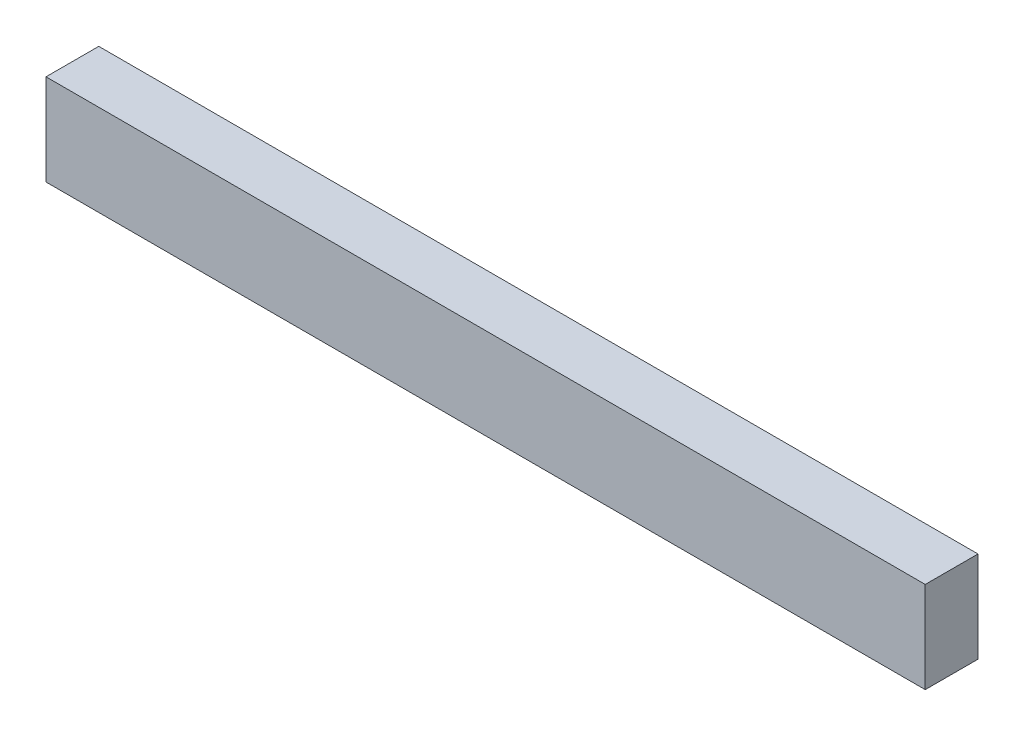
ISO-10303-21;
HEADER;
FILE_DESCRIPTION(('STEP AP214'),'2;1');
FILE_NAME('part.step','',(''),(''),'','','');
FILE_SCHEMA(('AUTOMOTIVE_DESIGN { 1 0 10303 214 1 1 1 1 }'));
ENDSEC;
DATA;
#1=APPLICATION_CONTEXT('core data for automotive mechanical design processes');
#2=APPLICATION_PROTOCOL_DEFINITION('international standard','automotive_design',2000,#1);
#3=PRODUCT_CONTEXT('',#1,'mechanical');
#4=PRODUCT('Part','Part','',(#3));
#5=PRODUCT_RELATED_PRODUCT_CATEGORY('part','',(#4));
#6=PRODUCT_DEFINITION_FORMATION('','',#4);
#7=PRODUCT_DEFINITION_CONTEXT('part definition',#1,'design');
#8=PRODUCT_DEFINITION('design','',#6,#7);
#9=PRODUCT_DEFINITION_SHAPE('','',#8);
#10=(LENGTH_UNIT() NAMED_UNIT(*) SI_UNIT(.MILLI.,.METRE.));
#11=(NAMED_UNIT(*) PLANE_ANGLE_UNIT() SI_UNIT($,.RADIAN.));
#12=(NAMED_UNIT(*) SI_UNIT($,.STERADIAN.) SOLID_ANGLE_UNIT());
#13=UNCERTAINTY_MEASURE_WITH_UNIT(LENGTH_MEASURE(1.E-05),#10,'distance_accuracy_value','');
#14=(GEOMETRIC_REPRESENTATION_CONTEXT(3) GLOBAL_UNCERTAINTY_ASSIGNED_CONTEXT((#13)) GLOBAL_UNIT_ASSIGNED_CONTEXT((#10,
#11,#12)) REPRESENTATION_CONTEXT('',''));
#15=CARTESIAN_POINT('',(0.,0.,0.));
#16=DIRECTION('',(0.,0.,1.));
#17=DIRECTION('',(1.,0.,0.));
#18=AXIS2_PLACEMENT_3D('',#15,#16,#17);
#19=CARTESIAN_POINT('',(63.4945060598473,-6.58109937156229,7.62));
#20=DIRECTION('',(-1.,0.,0.));
#21=DIRECTION('',(0.,0.,1.));
#22=AXIS2_PLACEMENT_3D('',#19,#20,#21);
#23=PLANE('',#22);
#24=DIRECTION('',(0.,1.,0.));
#25=VECTOR('',#24,1.);
#26=CARTESIAN_POINT('',(63.4945060598473,-6.58109937156229,0.));
#27=LINE('',#26,#25);
#28=CARTESIAN_POINT('',(63.4945060598473,-6.58109937156229,0.));
#29=VERTEX_POINT('',#28);
#30=CARTESIAN_POINT('',(63.4945060598473,6.58109937156229,0.));
#31=VERTEX_POINT('',#30);
#32=EDGE_CURVE('E99',#29,#31,#27,.T.);
#33=ORIENTED_EDGE('',*,*,#32,.T.);
#34=DIRECTION('',(0.,0.,-1.));
#35=VECTOR('',#34,1.);
#36=CARTESIAN_POINT('',(63.4945060598473,6.58109937156229,7.62));
#37=LINE('',#36,#35);
#38=CARTESIAN_POINT('',(63.4945060598473,6.58109937156229,7.62));
#39=VERTEX_POINT('',#38);
#40=EDGE_CURVE('E11',#39,#31,#37,.T.);
#41=ORIENTED_EDGE('',*,*,#40,.F.);
#42=DIRECTION('',(0.,1.,0.));
#43=VECTOR('',#42,1.);
#44=CARTESIAN_POINT('',(63.4945060598473,-6.58109937156229,7.62));
#45=LINE('',#44,#43);
#46=CARTESIAN_POINT('',(63.4945060598473,-6.58109937156229,7.62));
#47=VERTEX_POINT('',#46);
#48=EDGE_CURVE('E87',#47,#39,#45,.T.);
#49=ORIENTED_EDGE('',*,*,#48,.F.);
#50=DIRECTION('',(0.,0.,-1.));
#51=VECTOR('',#50,1.);
#52=CARTESIAN_POINT('',(63.4945060598473,-6.58109937156229,7.62));
#53=LINE('',#52,#51);
#54=EDGE_CURVE('E95',#47,#29,#53,.T.);
#55=ORIENTED_EDGE('',*,*,#54,.T.);
#56=EDGE_LOOP('',(#33,#41,#49,#55));
#57=FACE_BOUND('',#56,.T.);
#58=ADVANCED_FACE('F36',(#57),#23,.F.);
#59=CARTESIAN_POINT('',(-63.4945060598473,6.58109937156229,7.62));
#60=DIRECTION('',(0.,-1.,0.));
#61=DIRECTION('',(0.,0.,-1.));
#62=AXIS2_PLACEMENT_3D('',#59,#60,#61);
#63=PLANE('',#62);
#64=DIRECTION('',(-1.,0.,0.));
#65=VECTOR('',#64,1.);
#66=CARTESIAN_POINT('',(-63.4945060598473,6.58109937156229,0.));
#67=LINE('',#66,#65);
#68=CARTESIAN_POINT('',(-63.4945060598473,6.58109937156229,0.));
#69=VERTEX_POINT('',#68);
#70=EDGE_CURVE('E91',#31,#69,#67,.T.);
#71=ORIENTED_EDGE('',*,*,#70,.T.);
#72=DIRECTION('',(0.,0.,-1.));
#73=VECTOR('',#72,1.);
#74=CARTESIAN_POINT('',(-63.4945060598473,6.58109937156229,7.62));
#75=LINE('',#74,#73);
#76=CARTESIAN_POINT('',(-63.4945060598473,6.58109937156229,7.62));
#77=VERTEX_POINT('',#76);
#78=EDGE_CURVE('E44',#77,#69,#75,.T.);
#79=ORIENTED_EDGE('',*,*,#78,.F.);
#80=DIRECTION('',(-1.,0.,0.));
#81=VECTOR('',#80,1.);
#82=CARTESIAN_POINT('',(-63.4945060598473,6.58109937156229,7.62));
#83=LINE('',#82,#81);
#84=EDGE_CURVE('E82',#39,#77,#83,.T.);
#85=ORIENTED_EDGE('',*,*,#84,.F.);
#86=ORIENTED_EDGE('',*,*,#40,.T.);
#87=EDGE_LOOP('',(#71,#79,#85,#86));
#88=FACE_BOUND('',#87,.T.);
#89=ADVANCED_FACE('F90',(#88),#63,.F.);
#90=CARTESIAN_POINT('',(-63.4945060598473,-6.58109937156229,7.62));
#91=DIRECTION('',(1.,0.,0.));
#92=DIRECTION('',(0.,0.,-1.));
#93=AXIS2_PLACEMENT_3D('',#90,#91,#92);
#94=PLANE('',#93);
#95=DIRECTION('',(0.,-1.,0.));
#96=VECTOR('',#95,1.);
#97=CARTESIAN_POINT('',(-63.4945060598473,-6.58109937156229,0.));
#98=LINE('',#97,#96);
#99=CARTESIAN_POINT('',(-63.4945060598473,-6.58109937156229,0.));
#100=VERTEX_POINT('',#99);
#101=EDGE_CURVE('E69',#69,#100,#98,.T.);
#102=ORIENTED_EDGE('',*,*,#101,.T.);
#103=DIRECTION('',(0.,0.,-1.));
#104=VECTOR('',#103,1.);
#105=CARTESIAN_POINT('',(-63.4945060598473,-6.58109937156229,7.62));
#106=LINE('',#105,#104);
#107=CARTESIAN_POINT('',(-63.4945060598473,-6.58109937156229,7.62));
#108=VERTEX_POINT('',#107);
#109=EDGE_CURVE('E92',#108,#100,#106,.T.);
#110=ORIENTED_EDGE('',*,*,#109,.F.);
#111=DIRECTION('',(0.,-1.,0.));
#112=VECTOR('',#111,1.);
#113=CARTESIAN_POINT('',(-63.4945060598473,-6.58109937156229,7.62));
#114=LINE('',#113,#112);
#115=EDGE_CURVE('E85',#77,#108,#114,.T.);
#116=ORIENTED_EDGE('',*,*,#115,.F.);
#117=ORIENTED_EDGE('',*,*,#78,.T.);
#118=EDGE_LOOP('',(#102,#110,#116,#117));
#119=FACE_BOUND('',#118,.T.);
#120=ADVANCED_FACE('F93',(#119),#94,.F.);
#121=CARTESIAN_POINT('',(-63.4945060598473,-6.58109937156229,7.62));
#122=DIRECTION('',(0.,1.,0.));
#123=DIRECTION('',(0.,0.,1.));
#124=AXIS2_PLACEMENT_3D('',#121,#122,#123);
#125=PLANE('',#124);
#126=DIRECTION('',(1.,0.,0.));
#127=VECTOR('',#126,1.);
#128=CARTESIAN_POINT('',(-63.4945060598473,-6.58109937156229,0.));
#129=LINE('',#128,#127);
#130=EDGE_CURVE('E75',#100,#29,#129,.T.);
#131=ORIENTED_EDGE('',*,*,#130,.T.);
#132=ORIENTED_EDGE('',*,*,#54,.F.);
#133=DIRECTION('',(1.,0.,0.));
#134=VECTOR('',#133,1.);
#135=CARTESIAN_POINT('',(-63.4945060598473,-6.58109937156229,7.62));
#136=LINE('',#135,#134);
#137=EDGE_CURVE('E52',#108,#47,#136,.T.);
#138=ORIENTED_EDGE('',*,*,#137,.F.);
#139=ORIENTED_EDGE('',*,*,#109,.T.);
#140=EDGE_LOOP('',(#131,#132,#138,#139));
#141=FACE_BOUND('',#140,.T.);
#142=ADVANCED_FACE('F107',(#141),#125,.F.);
#143=CARTESIAN_POINT('',(0.,0.,7.62));
#144=DIRECTION('',(0.,0.,-1.));
#145=DIRECTION('',(-1.,0.,0.));
#146=AXIS2_PLACEMENT_3D('',#143,#144,#145);
#147=PLANE('',#146);
#148=ORIENTED_EDGE('',*,*,#48,.T.);
#149=ORIENTED_EDGE('',*,*,#84,.T.);
#150=ORIENTED_EDGE('',*,*,#115,.T.);
#151=ORIENTED_EDGE('',*,*,#137,.T.);
#152=EDGE_LOOP('',(#148,#149,#150,#151));
#153=FACE_BOUND('',#152,.T.);
#154=ADVANCED_FACE('F83',(#153),#147,.F.);
#155=CARTESIAN_POINT('',(0.,0.,0.));
#156=DIRECTION('',(0.,0.,-1.));
#157=DIRECTION('',(-1.,0.,0.));
#158=AXIS2_PLACEMENT_3D('',#155,#156,#157);
#159=PLANE('',#158);
#160=CARTESIAN_POINT('',(-52.0249464612942,0.,0.));
#161=DIRECTION('',(0.,0.,-1.));
#162=DIRECTION('',(-1.,0.,0.));
#163=AXIS2_PLACEMENT_3D('',#160,#161,#162);
#164=CIRCLE('',#163,4.3688);
#165=CARTESIAN_POINT('',(-56.3937464612942,0.,0.));
#166=VERTEX_POINT('',#165);
#167=EDGE_CURVE('E113',#166,#166,#164,.T.);
#168=ORIENTED_EDGE('',*,*,#167,.F.);
#169=EDGE_LOOP('',(#168));
#170=FACE_BOUND('',#169,.T.);
#171=ORIENTED_EDGE('',*,*,#32,.F.);
#172=ORIENTED_EDGE('',*,*,#130,.F.);
#173=ORIENTED_EDGE('',*,*,#101,.F.);
#174=ORIENTED_EDGE('',*,*,#70,.F.);
#175=EDGE_LOOP('',(#171,#172,#173,#174));
#176=FACE_BOUND('',#175,.T.);
#177=ADVANCED_FACE('F110',(#170,#176),#159,.T.);
#178=CARTESIAN_POINT('',(-52.0249464612942,0.,4.318));
#179=DIRECTION('',(0.,0.,-1.));
#180=DIRECTION('',(-1.,0.,0.));
#181=AXIS2_PLACEMENT_3D('',#178,#179,#180);
#182=CYLINDRICAL_SURFACE('',#181,4.3688);
#183=CARTESIAN_POINT('',(-52.0249464612942,0.,4.318));
#184=DIRECTION('',(0.,0.,-1.));
#185=DIRECTION('',(-1.,0.,0.));
#186=AXIS2_PLACEMENT_3D('',#183,#184,#185);
#187=CIRCLE('',#186,4.3688);
#188=CARTESIAN_POINT('',(-56.3937464612942,0.,4.318));
#189=VERTEX_POINT('',#188);
#190=EDGE_CURVE('E102',#189,#189,#187,.T.);
#191=ORIENTED_EDGE('',*,*,#190,.F.);
#192=EDGE_LOOP('',(#191));
#193=FACE_BOUND('',#192,.T.);
#194=ORIENTED_EDGE('',*,*,#167,.T.);
#195=EDGE_LOOP('',(#194));
#196=FACE_BOUND('',#195,.T.);
#197=ADVANCED_FACE('F121',(#193,#196),#182,.F.);
#198=CARTESIAN_POINT('',(-52.0249464612942,0.,4.318));
#199=DIRECTION('',(0.,0.,-1.));
#200=DIRECTION('',(-1.,0.,0.));
#201=AXIS2_PLACEMENT_3D('',#198,#199,#200);
#202=PLANE('',#201);
#203=ORIENTED_EDGE('',*,*,#190,.T.);
#204=EDGE_LOOP('',(#203));
#205=FACE_BOUND('',#204,.T.);
#206=ADVANCED_FACE('F119',(#205),#202,.T.);
#207=CLOSED_SHELL('',(#58,#89,#120,#142,#154,#177,#197,#206));
#208=MANIFOLD_SOLID_BREP('B2',#207);
#209=ADVANCED_BREP_SHAPE_REPRESENTATION('',(#18,#208),#14);
#210=SHAPE_DEFINITION_REPRESENTATION(#9,#209);
ENDSEC;
END-ISO-10303-21;
